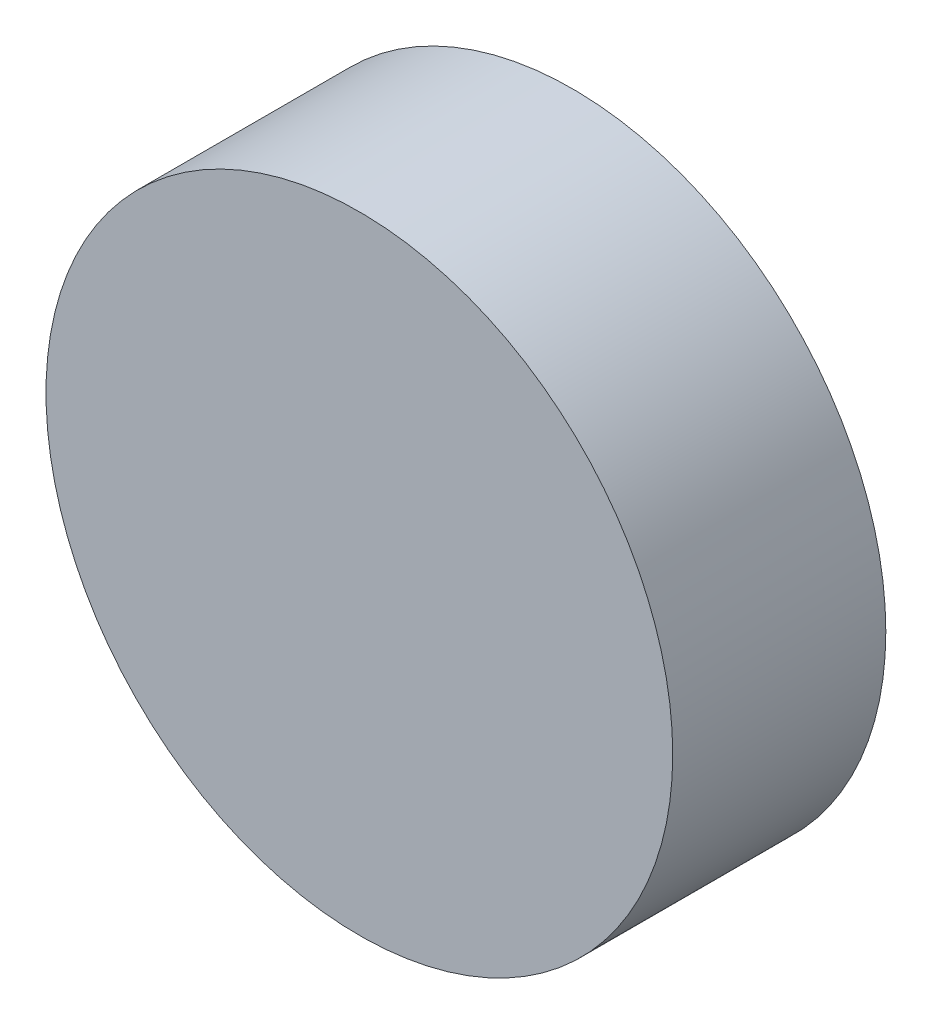
ISO-10303-21;
HEADER;
FILE_DESCRIPTION(('STEP AP214'),'2;1');
FILE_NAME('part.step','',(''),(''),'','','');
FILE_SCHEMA(('AUTOMOTIVE_DESIGN { 1 0 10303 214 1 1 1 1 }'));
ENDSEC;
DATA;
#1=APPLICATION_CONTEXT('core data for automotive mechanical design processes');
#2=APPLICATION_PROTOCOL_DEFINITION('international standard','automotive_design',2000,#1);
#3=PRODUCT_CONTEXT('',#1,'mechanical');
#4=PRODUCT('Part','Part','',(#3));
#5=PRODUCT_RELATED_PRODUCT_CATEGORY('part','',(#4));
#6=PRODUCT_DEFINITION_FORMATION('','',#4);
#7=PRODUCT_DEFINITION_CONTEXT('part definition',#1,'design');
#8=PRODUCT_DEFINITION('design','',#6,#7);
#9=PRODUCT_DEFINITION_SHAPE('','',#8);
#10=(LENGTH_UNIT() NAMED_UNIT(*) SI_UNIT(.MILLI.,.METRE.));
#11=(NAMED_UNIT(*) PLANE_ANGLE_UNIT() SI_UNIT($,.RADIAN.));
#12=(NAMED_UNIT(*) SI_UNIT($,.STERADIAN.) SOLID_ANGLE_UNIT());
#13=UNCERTAINTY_MEASURE_WITH_UNIT(LENGTH_MEASURE(1.E-05),#10,'distance_accuracy_value','');
#14=(GEOMETRIC_REPRESENTATION_CONTEXT(3) GLOBAL_UNCERTAINTY_ASSIGNED_CONTEXT((#13)) GLOBAL_UNIT_ASSIGNED_CONTEXT((#10,
#11,#12)) REPRESENTATION_CONTEXT('',''));
#15=CARTESIAN_POINT('',(0.,0.,0.));
#16=DIRECTION('',(0.,0.,1.));
#17=DIRECTION('',(1.,0.,0.));
#18=AXIS2_PLACEMENT_3D('',#15,#16,#17);
#19=CARTESIAN_POINT('',(0.,0.,0.));
#20=DIRECTION('',(0.,0.,1.));
#21=DIRECTION('',(1.,0.,0.));
#22=AXIS2_PLACEMENT_3D('',#19,#20,#21);
#23=PLANE('',#22);
#24=CARTESIAN_POINT('',(18.1865334794733,-10.4999999999998,0.));
#25=DIRECTION('',(0.,0.,-1.));
#26=DIRECTION('',(-1.,0.,0.));
#27=AXIS2_PLACEMENT_3D('',#24,#25,#26);
#28=CIRCLE('',#27,1.5);
#29=CARTESIAN_POINT('',(16.6865334794733,-10.4999999999998,0.));
#30=VERTEX_POINT('',#29);
#31=EDGE_CURVE('E209',#30,#30,#28,.T.);
#32=ORIENTED_EDGE('',*,*,#31,.F.);
#33=EDGE_LOOP('',(#32));
#34=FACE_BOUND('',#33,.T.);
#35=CARTESIAN_POINT('',(-18.1865334794732,-10.5000000000001,0.));
#36=DIRECTION('',(0.,0.,-1.));
#37=DIRECTION('',(-1.,0.,0.));
#38=AXIS2_PLACEMENT_3D('',#35,#36,#37);
#39=CIRCLE('',#38,1.5);
#40=CARTESIAN_POINT('',(-19.6865334794732,-10.5000000000001,0.));
#41=VERTEX_POINT('',#40);
#42=EDGE_CURVE('E221',#41,#41,#39,.T.);
#43=ORIENTED_EDGE('',*,*,#42,.F.);
#44=EDGE_LOOP('',(#43));
#45=FACE_BOUND('',#44,.T.);
#46=CARTESIAN_POINT('',(0.,21.,0.));
#47=DIRECTION('',(0.,0.,-1.));
#48=DIRECTION('',(-1.,0.,0.));
#49=AXIS2_PLACEMENT_3D('',#46,#47,#48);
#50=CIRCLE('',#49,1.5);
#51=CARTESIAN_POINT('',(-1.5,21.,0.));
#52=VERTEX_POINT('',#51);
#53=EDGE_CURVE('E227',#52,#52,#50,.T.);
#54=ORIENTED_EDGE('',*,*,#53,.F.);
#55=EDGE_LOOP('',(#54));
#56=FACE_BOUND('',#55,.T.);
#57=CARTESIAN_POINT('',(0.,0.,0.));
#58=DIRECTION('',(0.,0.,1.));
#59=DIRECTION('',(1.,0.,0.));
#60=AXIS2_PLACEMENT_3D('',#57,#58,#59);
#61=CIRCLE('',#60,25.);
#62=CARTESIAN_POINT('',(25.,0.,0.));
#63=VERTEX_POINT('',#62);
#64=EDGE_CURVE('E233',#63,#63,#61,.T.);
#65=ORIENTED_EDGE('',*,*,#64,.F.);
#66=EDGE_LOOP('',(#65));
#67=FACE_BOUND('',#66,.T.);
#68=CARTESIAN_POINT('',(-18.1865334794732,-10.5000000000001,0.));
#69=DIRECTION('',(0.,0.,1.));
#70=DIRECTION('',(-1.,0.,0.));
#71=AXIS2_PLACEMENT_3D('',#68,#69,#70);
#72=CIRCLE('',#71,4.);
#73=CARTESIAN_POINT('',(-15.8657099960918,-13.7578794267109,0.));
#74=VERTEX_POINT('',#73);
#75=CARTESIAN_POINT('',(-19.8475280837807,-6.86116819233691,0.));
#76=VERTEX_POINT('',#75);
#77=EDGE_CURVE('E167',#74,#76,#72,.T.);
#78=ORIENTED_EDGE('',*,*,#77,.F.);
#79=CARTESIAN_POINT('',(0.,0.,0.));
#80=DIRECTION('',(0.,0.,-1.));
#81=DIRECTION('',(-1.,0.,0.));
#82=AXIS2_PLACEMENT_3D('',#79,#80,#81);
#83=CIRCLE('',#82,21.);
#84=CARTESIAN_POINT('',(15.8657099960919,-13.7578794267106,0.));
#85=VERTEX_POINT('',#84);
#86=EDGE_CURVE('E48',#85,#74,#83,.T.);
#87=ORIENTED_EDGE('',*,*,#86,.F.);
#88=CARTESIAN_POINT('',(18.1865334794733,-10.4999999999998,0.));
#89=DIRECTION('',(0.,0.,1.));
#90=DIRECTION('',(-1.,0.,0.));
#91=AXIS2_PLACEMENT_3D('',#88,#89,#90);
#92=CIRCLE('',#91,4.);
#93=CARTESIAN_POINT('',(19.8475280837808,-6.86116819233663,0.));
#94=VERTEX_POINT('',#93);
#95=EDGE_CURVE('E141',#94,#85,#92,.T.);
#96=ORIENTED_EDGE('',*,*,#95,.F.);
#97=CARTESIAN_POINT('',(0.,0.,0.));
#98=DIRECTION('',(0.,0.,-1.));
#99=DIRECTION('',(-1.,0.,0.));
#100=AXIS2_PLACEMENT_3D('',#97,#98,#99);
#101=CIRCLE('',#100,21.);
#102=CARTESIAN_POINT('',(3.98181808768893,20.6190476190476,0.));
#103=VERTEX_POINT('',#102);
#104=EDGE_CURVE('E176',#103,#94,#101,.T.);
#105=ORIENTED_EDGE('',*,*,#104,.F.);
#106=CARTESIAN_POINT('',(0.,21.,0.));
#107=DIRECTION('',(0.,0.,1.));
#108=DIRECTION('',(-1.,0.,0.));
#109=AXIS2_PLACEMENT_3D('',#106,#107,#108);
#110=CIRCLE('',#109,4.);
#111=CARTESIAN_POINT('',(-3.98181808768894,20.6190476190476,0.));
#112=VERTEX_POINT('',#111);
#113=EDGE_CURVE('E173',#112,#103,#110,.T.);
#114=ORIENTED_EDGE('',*,*,#113,.F.);
#115=CARTESIAN_POINT('',(0.,0.,0.));
#116=DIRECTION('',(0.,0.,-1.));
#117=DIRECTION('',(-1.,0.,0.));
#118=AXIS2_PLACEMENT_3D('',#115,#116,#117);
#119=CIRCLE('',#118,21.);
#120=EDGE_CURVE('E170',#76,#112,#119,.T.);
#121=ORIENTED_EDGE('',*,*,#120,.F.);
#122=EDGE_LOOP('',(#78,#87,#96,#105,#114,#121));
#123=FACE_BOUND('',#122,.T.);
#124=ADVANCED_FACE('F33',(#34,#45,#56,#67,#123),#23,.F.);
#125=CARTESIAN_POINT('',(0.,-7.75,0.));
#126=DIRECTION('',(0.,-1.,0.));
#127=DIRECTION('',(1.,0.,0.));
#128=AXIS2_PLACEMENT_3D('',#125,#126,#127);
#129=PLANE('',#128);
#130=DIRECTION('',(0.,0.,-1.));
#131=VECTOR('',#130,1.);
#132=CARTESIAN_POINT('',(-6.98243317317344,-7.74999999999995,1.39785115936742));
#133=LINE('',#132,#131);
#134=CARTESIAN_POINT('',(-6.98243317317344,-7.74999999999995,15.3978511593674));
#135=VERTEX_POINT('',#134);
#136=CARTESIAN_POINT('',(-6.98243317317344,-7.74999999999996,15.));
#137=VERTEX_POINT('',#136);
#138=EDGE_CURVE('E197',#135,#137,#133,.T.);
#139=ORIENTED_EDGE('',*,*,#138,.T.);
#140=DIRECTION('',(1.,0.,0.));
#141=VECTOR('',#140,1.);
#142=CARTESIAN_POINT('',(0.,-7.75,15.));
#143=LINE('',#142,#141);
#144=CARTESIAN_POINT('',(8.66744619023216,-7.75000000000006,15.));
#145=VERTEX_POINT('',#144);
#146=EDGE_CURVE('E251',#137,#145,#143,.T.);
#147=ORIENTED_EDGE('',*,*,#146,.T.);
#148=DIRECTION('',(0.,0.,1.));
#149=VECTOR('',#148,1.);
#150=CARTESIAN_POINT('',(8.66744619023217,-7.75000000000006,1.39785115936742));
#151=LINE('',#150,#149);
#152=CARTESIAN_POINT('',(8.66744619023216,-7.75000000000006,15.3978511593674));
#153=VERTEX_POINT('',#152);
#154=EDGE_CURVE('E200',#145,#153,#151,.T.);
#155=ORIENTED_EDGE('',*,*,#154,.T.);
#156=DIRECTION('',(-1.,0.,0.));
#157=VECTOR('',#156,1.);
#158=CARTESIAN_POINT('',(8.66744619023216,-7.75000000000006,15.3978511593674));
#159=LINE('',#158,#157);
#160=EDGE_CURVE('E202',#153,#135,#159,.T.);
#161=ORIENTED_EDGE('',*,*,#160,.T.);
#162=EDGE_LOOP('',(#139,#147,#155,#161));
#163=FACE_BOUND('',#162,.T.);
#164=ADVANCED_FACE('F284',(#163),#129,.T.);
#165=CARTESIAN_POINT('',(0.,0.,17.));
#166=DIRECTION('',(0.,0.,-1.));
#167=DIRECTION('',(-1.,0.,0.));
#168=AXIS2_PLACEMENT_3D('',#165,#166,#167);
#169=CYLINDRICAL_SURFACE('',#168,25.);
#170=DIRECTION('',(0.,0.,-1.));
#171=VECTOR('',#170,1.);
#172=CARTESIAN_POINT('',(8.66744619023205,-23.4494216674832,17.));
#173=LINE('',#172,#171);
#174=CARTESIAN_POINT('',(8.66744619023205,-23.4494216674832,15.3978511593674));
#175=VERTEX_POINT('',#174);
#176=CARTESIAN_POINT('',(8.66744619023206,-23.4494216674832,1.39785115936742));
#177=VERTEX_POINT('',#176);
#178=EDGE_CURVE('E248',#175,#177,#173,.T.);
#179=ORIENTED_EDGE('',*,*,#178,.T.);
#180=CARTESIAN_POINT('',(0.,0.,1.39785115936742));
#181=DIRECTION('',(0.,0.,-1.));
#182=DIRECTION('',(-1.,0.,0.));
#183=AXIS2_PLACEMENT_3D('',#180,#181,#182);
#184=CIRCLE('',#183,25.);
#185=CARTESIAN_POINT('',(-6.98243317317356,-24.0051166833691,1.39785115936742));
#186=VERTEX_POINT('',#185);
#187=EDGE_CURVE('E237',#177,#186,#184,.T.);
#188=ORIENTED_EDGE('',*,*,#187,.T.);
#189=DIRECTION('',(0.,0.,-1.));
#190=VECTOR('',#189,1.);
#191=CARTESIAN_POINT('',(-6.98243317317356,-24.0051166833691,17.));
#192=LINE('',#191,#190);
#193=CARTESIAN_POINT('',(-6.98243317317356,-24.0051166833691,15.3978511593674));
#194=VERTEX_POINT('',#193);
#195=EDGE_CURVE('E245',#186,#194,#192,.F.);
#196=ORIENTED_EDGE('',*,*,#195,.T.);
#197=CARTESIAN_POINT('',(0.,0.,15.3978511593674));
#198=DIRECTION('',(0.,0.,1.));
#199=DIRECTION('',(1.,0.,0.));
#200=AXIS2_PLACEMENT_3D('',#197,#198,#199);
#201=CIRCLE('',#200,25.);
#202=EDGE_CURVE('E242',#194,#175,#201,.T.);
#203=ORIENTED_EDGE('',*,*,#202,.T.);
#204=EDGE_LOOP('',(#179,#188,#196,#203));
#205=FACE_BOUND('',#204,.T.);
#206=CARTESIAN_POINT('',(0.,0.,17.));
#207=DIRECTION('',(0.,0.,1.));
#208=DIRECTION('',(1.,0.,0.));
#209=AXIS2_PLACEMENT_3D('',#206,#207,#208);
#210=CIRCLE('',#209,25.);
#211=CARTESIAN_POINT('',(25.,0.,17.));
#212=VERTEX_POINT('',#211);
#213=EDGE_CURVE('E234',#212,#212,#210,.T.);
#214=ORIENTED_EDGE('',*,*,#213,.F.);
#215=EDGE_LOOP('',(#214));
#216=FACE_BOUND('',#215,.T.);
#217=ORIENTED_EDGE('',*,*,#64,.T.);
#218=EDGE_LOOP('',(#217));
#219=FACE_BOUND('',#218,.T.);
#220=ADVANCED_FACE('F35',(#205,#216,#219),#169,.T.);
#221=CARTESIAN_POINT('',(0.,0.,17.));
#222=DIRECTION('',(0.,0.,1.));
#223=DIRECTION('',(1.,0.,0.));
#224=AXIS2_PLACEMENT_3D('',#221,#222,#223);
#225=PLANE('',#224);
#226=ORIENTED_EDGE('',*,*,#213,.T.);
#227=EDGE_LOOP('',(#226));
#228=FACE_BOUND('',#227,.T.);
#229=ADVANCED_FACE('F294',(#228),#225,.T.);
#230=CARTESIAN_POINT('',(0.,21.,5.));
#231=DIRECTION('',(0.,0.,-1.));
#232=DIRECTION('',(-1.,0.,0.));
#233=AXIS2_PLACEMENT_3D('',#230,#231,#232);
#234=CONICAL_SURFACE('',#233,1.5,1.02974425867665);
#235=CARTESIAN_POINT('',(0.,21.,5.90129092854134));
#236=VERTEX_POINT('',#235);
#237=VERTEX_LOOP('',#236);
#238=FACE_BOUND('',#237,.T.);
#239=CARTESIAN_POINT('',(0.,21.,5.));
#240=DIRECTION('',(0.,0.,-1.));
#241=DIRECTION('',(-1.,0.,0.));
#242=AXIS2_PLACEMENT_3D('',#239,#240,#241);
#243=CIRCLE('',#242,1.5);
#244=CARTESIAN_POINT('',(-1.5,21.,5.));
#245=VERTEX_POINT('',#244);
#246=EDGE_CURVE('E230',#245,#245,#243,.T.);
#247=ORIENTED_EDGE('',*,*,#246,.T.);
#248=EDGE_LOOP('',(#247));
#249=FACE_BOUND('',#248,.T.);
#250=ADVANCED_FACE('F297',(#238,#249),#234,.F.);
#251=CARTESIAN_POINT('',(0.,21.,0.));
#252=DIRECTION('',(0.,0.,-1.));
#253=DIRECTION('',(-1.,0.,0.));
#254=AXIS2_PLACEMENT_3D('',#251,#252,#253);
#255=CYLINDRICAL_SURFACE('',#254,1.5);
#256=ORIENTED_EDGE('',*,*,#246,.F.);
#257=EDGE_LOOP('',(#256));
#258=FACE_BOUND('',#257,.T.);
#259=ORIENTED_EDGE('',*,*,#53,.T.);
#260=EDGE_LOOP('',(#259));
#261=FACE_BOUND('',#260,.T.);
#262=ADVANCED_FACE('F301',(#258,#261),#255,.F.);
#263=CARTESIAN_POINT('',(-18.1865334794732,-10.5000000000001,5.));
#264=DIRECTION('',(0.,0.,-1.));
#265=DIRECTION('',(-1.,0.,0.));
#266=AXIS2_PLACEMENT_3D('',#263,#264,#265);
#267=CONICAL_SURFACE('',#266,1.5,1.02974425867665);
#268=CARTESIAN_POINT('',(-18.1865334794732,-10.5000000000001,5.90129092854134));
#269=VERTEX_POINT('',#268);
#270=VERTEX_LOOP('',#269);
#271=FACE_BOUND('',#270,.T.);
#272=CARTESIAN_POINT('',(-18.1865334794732,-10.5000000000001,5.));
#273=DIRECTION('',(0.,0.,-1.));
#274=DIRECTION('',(-1.,0.,0.));
#275=AXIS2_PLACEMENT_3D('',#272,#273,#274);
#276=CIRCLE('',#275,1.5);
#277=CARTESIAN_POINT('',(-19.6865334794732,-10.5000000000001,5.));
#278=VERTEX_POINT('',#277);
#279=EDGE_CURVE('E224',#278,#278,#276,.T.);
#280=ORIENTED_EDGE('',*,*,#279,.T.);
#281=EDGE_LOOP('',(#280));
#282=FACE_BOUND('',#281,.T.);
#283=ADVANCED_FACE('F305',(#271,#282),#267,.F.);
#284=CARTESIAN_POINT('',(-18.1865334794732,-10.5000000000001,0.));
#285=DIRECTION('',(0.,0.,-1.));
#286=DIRECTION('',(-1.,0.,0.));
#287=AXIS2_PLACEMENT_3D('',#284,#285,#286);
#288=CYLINDRICAL_SURFACE('',#287,1.5);
#289=ORIENTED_EDGE('',*,*,#279,.F.);
#290=EDGE_LOOP('',(#289));
#291=FACE_BOUND('',#290,.T.);
#292=ORIENTED_EDGE('',*,*,#42,.T.);
#293=EDGE_LOOP('',(#292));
#294=FACE_BOUND('',#293,.T.);
#295=ADVANCED_FACE('F309',(#291,#294),#288,.F.);
#296=CARTESIAN_POINT('',(18.1865334794733,-10.4999999999998,5.));
#297=DIRECTION('',(0.,0.,-1.));
#298=DIRECTION('',(-1.,0.,0.));
#299=AXIS2_PLACEMENT_3D('',#296,#297,#298);
#300=CONICAL_SURFACE('',#299,1.5,1.02974425867665);
#301=CARTESIAN_POINT('',(18.1865334794733,-10.4999999999998,5.90129092854134));
#302=VERTEX_POINT('',#301);
#303=VERTEX_LOOP('',#302);
#304=FACE_BOUND('',#303,.T.);
#305=CARTESIAN_POINT('',(18.1865334794733,-10.4999999999998,5.));
#306=DIRECTION('',(0.,0.,-1.));
#307=DIRECTION('',(-1.,0.,0.));
#308=AXIS2_PLACEMENT_3D('',#305,#306,#307);
#309=CIRCLE('',#308,1.5);
#310=CARTESIAN_POINT('',(16.6865334794733,-10.4999999999998,5.));
#311=VERTEX_POINT('',#310);
#312=EDGE_CURVE('E218',#311,#311,#309,.T.);
#313=ORIENTED_EDGE('',*,*,#312,.T.);
#314=EDGE_LOOP('',(#313));
#315=FACE_BOUND('',#314,.T.);
#316=ADVANCED_FACE('F313',(#304,#315),#300,.F.);
#317=CARTESIAN_POINT('',(18.1865334794733,-10.4999999999998,0.));
#318=DIRECTION('',(0.,0.,-1.));
#319=DIRECTION('',(-1.,0.,0.));
#320=AXIS2_PLACEMENT_3D('',#317,#318,#319);
#321=CYLINDRICAL_SURFACE('',#320,1.5);
#322=ORIENTED_EDGE('',*,*,#312,.F.);
#323=EDGE_LOOP('',(#322));
#324=FACE_BOUND('',#323,.T.);
#325=ORIENTED_EDGE('',*,*,#31,.T.);
#326=EDGE_LOOP('',(#325));
#327=FACE_BOUND('',#326,.T.);
#328=ADVANCED_FACE('F317',(#324,#327),#321,.F.);
#329=CARTESIAN_POINT('',(-6.98243317317344,-7.74999999999995,1.39785115936742));
#330=DIRECTION('',(-1.,0.,0.));
#331=DIRECTION('',(0.,-1.,0.));
#332=AXIS2_PLACEMENT_3D('',#329,#330,#331);
#333=PLANE('',#332);
#334=DIRECTION('',(0.,-1.,0.));
#335=VECTOR('',#334,1.);
#336=CARTESIAN_POINT('',(-6.98243317317344,-7.74999999999995,1.39785115936742));
#337=LINE('',#336,#335);
#338=CARTESIAN_POINT('',(-6.98243317317353,-19.8051919198519,1.39785115936742));
#339=VERTEX_POINT('',#338);
#340=EDGE_CURVE('E205',#339,#186,#337,.T.);
#341=ORIENTED_EDGE('',*,*,#340,.F.);
#342=DIRECTION('',(0.,0.,-1.));
#343=VECTOR('',#342,1.);
#344=CARTESIAN_POINT('',(-6.98243317317353,-19.8051919198519,15.));
#345=LINE('',#344,#343);
#346=CARTESIAN_POINT('',(-6.98243317317353,-19.8051919198519,15.));
#347=VERTEX_POINT('',#346);
#348=EDGE_CURVE('E195',#339,#347,#345,.F.);
#349=ORIENTED_EDGE('',*,*,#348,.T.);
#350=DIRECTION('',(0.,-1.,0.));
#351=VECTOR('',#350,1.);
#352=CARTESIAN_POINT('',(-6.98243317317344,-7.74999999999995,15.));
#353=LINE('',#352,#351);
#354=EDGE_CURVE('E138',#137,#347,#353,.T.);
#355=ORIENTED_EDGE('',*,*,#354,.F.);
#356=ORIENTED_EDGE('',*,*,#138,.F.);
#357=DIRECTION('',(0.,-1.,0.));
#358=VECTOR('',#357,1.);
#359=CARTESIAN_POINT('',(-6.98243317317344,-7.74999999999995,15.3978511593674));
#360=LINE('',#359,#358);
#361=EDGE_CURVE('E206',#135,#194,#360,.T.);
#362=ORIENTED_EDGE('',*,*,#361,.T.);
#363=ORIENTED_EDGE('',*,*,#195,.F.);
#364=EDGE_LOOP('',(#341,#349,#355,#356,#362,#363));
#365=FACE_BOUND('',#364,.T.);
#366=ADVANCED_FACE('F321',(#365),#333,.F.);
#367=CARTESIAN_POINT('',(8.66744619023216,-7.75000000000006,15.3978511593674));
#368=DIRECTION('',(0.,0.,1.));
#369=DIRECTION('',(1.,0.,0.));
#370=AXIS2_PLACEMENT_3D('',#367,#368,#369);
#371=PLANE('',#370);
#372=ORIENTED_EDGE('',*,*,#361,.F.);
#373=ORIENTED_EDGE('',*,*,#160,.F.);
#374=DIRECTION('',(0.,-1.,0.));
#375=VECTOR('',#374,1.);
#376=CARTESIAN_POINT('',(8.66744619023216,-7.75000000000006,15.3978511593674));
#377=LINE('',#376,#375);
#378=EDGE_CURVE('E210',#153,#175,#377,.T.);
#379=ORIENTED_EDGE('',*,*,#378,.T.);
#380=ORIENTED_EDGE('',*,*,#202,.F.);
#381=EDGE_LOOP('',(#372,#373,#379,#380));
#382=FACE_BOUND('',#381,.T.);
#383=ADVANCED_FACE('F325',(#382),#371,.F.);
#384=CARTESIAN_POINT('',(8.66744619023217,-7.75000000000006,1.39785115936742));
#385=DIRECTION('',(1.,0.,0.));
#386=DIRECTION('',(0.,1.,0.));
#387=AXIS2_PLACEMENT_3D('',#384,#385,#386);
#388=PLANE('',#387);
#389=DIRECTION('',(0.,1.,0.));
#390=VECTOR('',#389,1.);
#391=CARTESIAN_POINT('',(8.66744619023216,-7.75000000000006,15.));
#392=LINE('',#391,#390);
#393=CARTESIAN_POINT('',(8.66744619023208,-19.1278691060827,15.));
#394=VERTEX_POINT('',#393);
#395=EDGE_CURVE('E56',#394,#145,#392,.T.);
#396=ORIENTED_EDGE('',*,*,#395,.F.);
#397=DIRECTION('',(0.,0.,-1.));
#398=VECTOR('',#397,1.);
#399=CARTESIAN_POINT('',(8.66744619023208,-19.1278691060827,15.));
#400=LINE('',#399,#398);
#401=CARTESIAN_POINT('',(8.66744619023209,-19.1278691060827,1.39785115936742));
#402=VERTEX_POINT('',#401);
#403=EDGE_CURVE('E192',#394,#402,#400,.T.);
#404=ORIENTED_EDGE('',*,*,#403,.T.);
#405=DIRECTION('',(0.,-1.,0.));
#406=VECTOR('',#405,1.);
#407=CARTESIAN_POINT('',(8.66744619023217,-7.75000000000006,1.39785115936742));
#408=LINE('',#407,#406);
#409=EDGE_CURVE('E213',#402,#177,#408,.T.);
#410=ORIENTED_EDGE('',*,*,#409,.T.);
#411=ORIENTED_EDGE('',*,*,#178,.F.);
#412=ORIENTED_EDGE('',*,*,#378,.F.);
#413=ORIENTED_EDGE('',*,*,#154,.F.);
#414=EDGE_LOOP('',(#396,#404,#410,#411,#412,#413));
#415=FACE_BOUND('',#414,.T.);
#416=ADVANCED_FACE('F330',(#415),#388,.F.);
#417=CARTESIAN_POINT('',(8.66744619023217,-7.75000000000006,1.39785115936742));
#418=DIRECTION('',(0.,0.,-1.));
#419=DIRECTION('',(-1.,0.,0.));
#420=AXIS2_PLACEMENT_3D('',#417,#418,#419);
#421=PLANE('',#420);
#422=ORIENTED_EDGE('',*,*,#409,.F.);
#423=CARTESIAN_POINT('',(0.,0.,1.39785115936742));
#424=DIRECTION('',(0.,0.,-1.));
#425=DIRECTION('',(-1.,0.,0.));
#426=AXIS2_PLACEMENT_3D('',#423,#424,#425);
#427=CIRCLE('',#426,21.);
#428=EDGE_CURVE('E253',#402,#339,#427,.T.);
#429=ORIENTED_EDGE('',*,*,#428,.T.);
#430=ORIENTED_EDGE('',*,*,#340,.T.);
#431=ORIENTED_EDGE('',*,*,#187,.F.);
#432=EDGE_LOOP('',(#422,#429,#430,#431));
#433=FACE_BOUND('',#432,.T.);
#434=ADVANCED_FACE('F327',(#433),#421,.F.);
#435=CARTESIAN_POINT('',(0.,0.,15.));
#436=DIRECTION('',(0.,0.,-1.));
#437=DIRECTION('',(-1.,0.,0.));
#438=AXIS2_PLACEMENT_3D('',#435,#436,#437);
#439=CYLINDRICAL_SURFACE('',#438,21.);
#440=ORIENTED_EDGE('',*,*,#428,.F.);
#441=ORIENTED_EDGE('',*,*,#403,.F.);
#442=CARTESIAN_POINT('',(0.,0.,15.));
#443=DIRECTION('',(0.,0.,-1.));
#444=DIRECTION('',(-1.,0.,0.));
#445=AXIS2_PLACEMENT_3D('',#442,#443,#444);
#446=CIRCLE('',#445,21.);
#447=CARTESIAN_POINT('',(15.8657099960919,-13.7578794267106,15.));
#448=VERTEX_POINT('',#447);
#449=EDGE_CURVE('E140',#448,#394,#446,.T.);
#450=ORIENTED_EDGE('',*,*,#449,.F.);
#451=DIRECTION('',(0.,0.,-1.));
#452=VECTOR('',#451,1.);
#453=CARTESIAN_POINT('',(15.8657099960919,-13.7578794267106,15.));
#454=LINE('',#453,#452);
#455=EDGE_CURVE('E181',#448,#85,#454,.T.);
#456=ORIENTED_EDGE('',*,*,#455,.T.);
#457=ORIENTED_EDGE('',*,*,#86,.T.);
#458=DIRECTION('',(0.,0.,-1.));
#459=VECTOR('',#458,1.);
#460=CARTESIAN_POINT('',(-15.8657099960918,-13.7578794267109,15.));
#461=LINE('',#460,#459);
#462=CARTESIAN_POINT('',(-15.8657099960918,-13.7578794267109,15.));
#463=VERTEX_POINT('',#462);
#464=EDGE_CURVE('E143',#463,#74,#461,.T.);
#465=ORIENTED_EDGE('',*,*,#464,.F.);
#466=EDGE_CURVE('E132',#347,#463,#446,.T.);
#467=ORIENTED_EDGE('',*,*,#466,.F.);
#468=ORIENTED_EDGE('',*,*,#348,.F.);
#469=EDGE_LOOP('',(#440,#441,#450,#456,#457,#465,#467,#468));
#470=FACE_BOUND('',#469,.T.);
#471=ADVANCED_FACE('F144',(#470),#439,.F.);
#472=CARTESIAN_POINT('',(-9.09326673973658,-5.25000000000004,15.));
#473=DIRECTION('',(0.,0.,-1.));
#474=DIRECTION('',(-1.,0.,0.));
#475=AXIS2_PLACEMENT_3D('',#472,#473,#474);
#476=PLANE('',#475);
#477=CARTESIAN_POINT('',(-7.,8.03883281399028,15.));
#478=DIRECTION('',(0.,0.,-1.));
#479=DIRECTION('',(1.,0.,0.));
#480=AXIS2_PLACEMENT_3D('',#477,#478,#479);
#481=CIRCLE('',#480,2.);
#482=CARTESIAN_POINT('',(-5.,8.03883281399028,15.));
#483=VERTEX_POINT('',#482);
#484=EDGE_CURVE('E510',#483,#483,#481,.T.);
#485=ORIENTED_EDGE('',*,*,#484,.F.);
#486=EDGE_LOOP('',(#485));
#487=FACE_BOUND('',#486,.T.);
#488=CARTESIAN_POINT('',(7.,8.03883281399028,15.));
#489=DIRECTION('',(0.,0.,-1.));
#490=DIRECTION('',(-1.,0.,0.));
#491=AXIS2_PLACEMENT_3D('',#488,#489,#490);
#492=CIRCLE('',#491,2.);
#493=CARTESIAN_POINT('',(5.,8.03883281399028,15.));
#494=VERTEX_POINT('',#493);
#495=EDGE_CURVE('E521',#494,#494,#492,.T.);
#496=ORIENTED_EDGE('',*,*,#495,.F.);
#497=EDGE_LOOP('',(#496));
#498=FACE_BOUND('',#497,.T.);
#499=ORIENTED_EDGE('',*,*,#354,.T.);
#500=ORIENTED_EDGE('',*,*,#466,.T.);
#501=CARTESIAN_POINT('',(-18.1865334794732,-10.5000000000001,15.));
#502=DIRECTION('',(0.,0.,1.));
#503=DIRECTION('',(-1.,0.,0.));
#504=AXIS2_PLACEMENT_3D('',#501,#502,#503);
#505=CIRCLE('',#504,4.);
#506=CARTESIAN_POINT('',(-19.8475280837807,-6.86116819233691,15.));
#507=VERTEX_POINT('',#506);
#508=EDGE_CURVE('E136',#463,#507,#505,.T.);
#509=ORIENTED_EDGE('',*,*,#508,.T.);
#510=CARTESIAN_POINT('',(0.,0.,15.));
#511=DIRECTION('',(0.,0.,-1.));
#512=DIRECTION('',(-1.,0.,0.));
#513=AXIS2_PLACEMENT_3D('',#510,#511,#512);
#514=CIRCLE('',#513,21.);
#515=CARTESIAN_POINT('',(-3.98181808768894,20.6190476190476,15.));
#516=VERTEX_POINT('',#515);
#517=EDGE_CURVE('E153',#507,#516,#514,.T.);
#518=ORIENTED_EDGE('',*,*,#517,.T.);
#519=CARTESIAN_POINT('',(0.,21.,15.));
#520=DIRECTION('',(0.,0.,1.));
#521=DIRECTION('',(-1.,0.,0.));
#522=AXIS2_PLACEMENT_3D('',#519,#520,#521);
#523=CIRCLE('',#522,4.);
#524=CARTESIAN_POINT('',(3.98181808768893,20.6190476190476,15.));
#525=VERTEX_POINT('',#524);
#526=EDGE_CURVE('E155',#516,#525,#523,.T.);
#527=ORIENTED_EDGE('',*,*,#526,.T.);
#528=CARTESIAN_POINT('',(0.,0.,15.));
#529=DIRECTION('',(0.,0.,-1.));
#530=DIRECTION('',(-1.,0.,0.));
#531=AXIS2_PLACEMENT_3D('',#528,#529,#530);
#532=CIRCLE('',#531,21.);
#533=CARTESIAN_POINT('',(19.8475280837808,-6.86116819233663,15.));
#534=VERTEX_POINT('',#533);
#535=EDGE_CURVE('E161',#525,#534,#532,.T.);
#536=ORIENTED_EDGE('',*,*,#535,.T.);
#537=CARTESIAN_POINT('',(18.1865334794733,-10.4999999999998,15.));
#538=DIRECTION('',(0.,0.,1.));
#539=DIRECTION('',(-1.,0.,0.));
#540=AXIS2_PLACEMENT_3D('',#537,#538,#539);
#541=CIRCLE('',#540,4.);
#542=EDGE_CURVE('E149',#534,#448,#541,.T.);
#543=ORIENTED_EDGE('',*,*,#542,.T.);
#544=ORIENTED_EDGE('',*,*,#449,.T.);
#545=ORIENTED_EDGE('',*,*,#395,.T.);
#546=ORIENTED_EDGE('',*,*,#146,.F.);
#547=EDGE_LOOP('',(#499,#500,#509,#518,#527,#536,#543,#544,#545,#546));
#548=FACE_BOUND('',#547,.T.);
#549=ADVANCED_FACE('F133',(#487,#498,#548),#476,.T.);
#550=CARTESIAN_POINT('',(18.1865334794733,-10.4999999999998,15.));
#551=DIRECTION('',(0.,0.,-1.));
#552=DIRECTION('',(-1.,0.,0.));
#553=AXIS2_PLACEMENT_3D('',#550,#551,#552);
#554=CYLINDRICAL_SURFACE('',#553,4.);
#555=ORIENTED_EDGE('',*,*,#95,.T.);
#556=ORIENTED_EDGE('',*,*,#455,.F.);
#557=ORIENTED_EDGE('',*,*,#542,.F.);
#558=DIRECTION('',(0.,0.,-1.));
#559=VECTOR('',#558,1.);
#560=CARTESIAN_POINT('',(19.8475280837808,-6.86116819233663,15.));
#561=LINE('',#560,#559);
#562=EDGE_CURVE('E183',#534,#94,#561,.T.);
#563=ORIENTED_EDGE('',*,*,#562,.T.);
#564=EDGE_LOOP('',(#555,#556,#557,#563));
#565=FACE_BOUND('',#564,.T.);
#566=ADVANCED_FACE('F278',(#565),#554,.T.);
#567=CARTESIAN_POINT('',(0.,0.,15.));
#568=DIRECTION('',(0.,0.,-1.));
#569=DIRECTION('',(-1.,0.,0.));
#570=AXIS2_PLACEMENT_3D('',#567,#568,#569);
#571=CYLINDRICAL_SURFACE('',#570,21.);
#572=ORIENTED_EDGE('',*,*,#104,.T.);
#573=ORIENTED_EDGE('',*,*,#562,.F.);
#574=ORIENTED_EDGE('',*,*,#535,.F.);
#575=DIRECTION('',(0.,0.,-1.));
#576=VECTOR('',#575,1.);
#577=CARTESIAN_POINT('',(3.98181808768893,20.6190476190476,15.));
#578=LINE('',#577,#576);
#579=EDGE_CURVE('E185',#525,#103,#578,.T.);
#580=ORIENTED_EDGE('',*,*,#579,.T.);
#581=EDGE_LOOP('',(#572,#573,#574,#580));
#582=FACE_BOUND('',#581,.T.);
#583=ADVANCED_FACE('F350',(#582),#571,.F.);
#584=CARTESIAN_POINT('',(0.,21.,15.));
#585=DIRECTION('',(0.,0.,-1.));
#586=DIRECTION('',(-1.,0.,0.));
#587=AXIS2_PLACEMENT_3D('',#584,#585,#586);
#588=CYLINDRICAL_SURFACE('',#587,4.);
#589=ORIENTED_EDGE('',*,*,#113,.T.);
#590=ORIENTED_EDGE('',*,*,#579,.F.);
#591=ORIENTED_EDGE('',*,*,#526,.F.);
#592=DIRECTION('',(0.,0.,-1.));
#593=VECTOR('',#592,1.);
#594=CARTESIAN_POINT('',(-3.98181808768894,20.6190476190476,15.));
#595=LINE('',#594,#593);
#596=EDGE_CURVE('E187',#516,#112,#595,.T.);
#597=ORIENTED_EDGE('',*,*,#596,.T.);
#598=EDGE_LOOP('',(#589,#590,#591,#597));
#599=FACE_BOUND('',#598,.T.);
#600=ADVANCED_FACE('F346',(#599),#588,.T.);
#601=CARTESIAN_POINT('',(0.,0.,15.));
#602=DIRECTION('',(0.,0.,-1.));
#603=DIRECTION('',(-1.,0.,0.));
#604=AXIS2_PLACEMENT_3D('',#601,#602,#603);
#605=CYLINDRICAL_SURFACE('',#604,21.);
#606=ORIENTED_EDGE('',*,*,#120,.T.);
#607=ORIENTED_EDGE('',*,*,#596,.F.);
#608=ORIENTED_EDGE('',*,*,#517,.F.);
#609=DIRECTION('',(0.,0.,-1.));
#610=VECTOR('',#609,1.);
#611=CARTESIAN_POINT('',(-19.8475280837807,-6.86116819233691,15.));
#612=LINE('',#611,#610);
#613=EDGE_CURVE('E148',#507,#76,#612,.T.);
#614=ORIENTED_EDGE('',*,*,#613,.T.);
#615=EDGE_LOOP('',(#606,#607,#608,#614));
#616=FACE_BOUND('',#615,.T.);
#617=ADVANCED_FACE('F343',(#616),#605,.F.);
#618=CARTESIAN_POINT('',(-18.1865334794732,-10.5000000000001,15.));
#619=DIRECTION('',(0.,0.,-1.));
#620=DIRECTION('',(-1.,0.,0.));
#621=AXIS2_PLACEMENT_3D('',#618,#619,#620);
#622=CYLINDRICAL_SURFACE('',#621,4.);
#623=ORIENTED_EDGE('',*,*,#77,.T.);
#624=ORIENTED_EDGE('',*,*,#613,.F.);
#625=ORIENTED_EDGE('',*,*,#508,.F.);
#626=ORIENTED_EDGE('',*,*,#464,.T.);
#627=EDGE_LOOP('',(#623,#624,#625,#626));
#628=FACE_BOUND('',#627,.T.);
#629=ADVANCED_FACE('F151',(#628),#622,.T.);
#630=CARTESIAN_POINT('',(7.,8.03883281399028,12.));
#631=DIRECTION('',(0.,0.,-1.));
#632=DIRECTION('',(-1.,0.,0.));
#633=AXIS2_PLACEMENT_3D('',#630,#631,#632);
#634=PLANE('',#633);
#635=CARTESIAN_POINT('',(7.,8.03883281399028,12.));
#636=DIRECTION('',(0.,0.,-1.));
#637=DIRECTION('',(-1.,0.,0.));
#638=AXIS2_PLACEMENT_3D('',#635,#636,#637);
#639=CIRCLE('',#638,2.);
#640=CARTESIAN_POINT('',(5.,8.03883281399028,12.));
#641=VERTEX_POINT('',#640);
#642=EDGE_CURVE('E168',#641,#641,#639,.T.);
#643=ORIENTED_EDGE('',*,*,#642,.T.);
#644=EDGE_LOOP('',(#643));
#645=FACE_BOUND('',#644,.T.);
#646=CARTESIAN_POINT('',(7.,8.03883281399028,12.));
#647=DIRECTION('',(0.,0.,-1.));
#648=DIRECTION('',(-1.,0.,0.));
#649=AXIS2_PLACEMENT_3D('',#646,#647,#648);
#650=CIRCLE('',#649,1.);
#651=CARTESIAN_POINT('',(6.,8.03883281399028,12.));
#652=VERTEX_POINT('',#651);
#653=EDGE_CURVE('E517',#652,#652,#650,.T.);
#654=ORIENTED_EDGE('',*,*,#653,.F.);
#655=EDGE_LOOP('',(#654));
#656=FACE_BOUND('',#655,.T.);
#657=ADVANCED_FACE('F342',(#645,#656),#634,.T.);
#658=CARTESIAN_POINT('',(7.,8.03883281399028,12.));
#659=DIRECTION('',(0.,0.,1.));
#660=DIRECTION('',(1.,0.,0.));
#661=AXIS2_PLACEMENT_3D('',#658,#659,#660);
#662=CYLINDRICAL_SURFACE('',#661,2.);
#663=ORIENTED_EDGE('',*,*,#642,.F.);
#664=EDGE_LOOP('',(#663));
#665=FACE_BOUND('',#664,.T.);
#666=ORIENTED_EDGE('',*,*,#495,.T.);
#667=EDGE_LOOP('',(#666));
#668=FACE_BOUND('',#667,.T.);
#669=ADVANCED_FACE('F272',(#665,#668),#662,.T.);
#670=CARTESIAN_POINT('',(7.,8.03883281399028,12.));
#671=DIRECTION('',(0.,0.,1.));
#672=DIRECTION('',(1.,0.,0.));
#673=AXIS2_PLACEMENT_3D('',#670,#671,#672);
#674=CYLINDRICAL_SURFACE('',#673,1.);
#675=ORIENTED_EDGE('',*,*,#653,.T.);
#676=EDGE_LOOP('',(#675));
#677=FACE_BOUND('',#676,.T.);
#678=CARTESIAN_POINT('',(7.,8.03883281399028,15.));
#679=DIRECTION('',(0.,0.,-1.));
#680=DIRECTION('',(-1.,0.,0.));
#681=AXIS2_PLACEMENT_3D('',#678,#679,#680);
#682=CIRCLE('',#681,1.);
#683=CARTESIAN_POINT('',(6.,8.03883281399028,15.));
#684=VERTEX_POINT('',#683);
#685=EDGE_CURVE('E41',#684,#684,#682,.F.);
#686=ORIENTED_EDGE('',*,*,#685,.T.);
#687=EDGE_LOOP('',(#686));
#688=FACE_BOUND('',#687,.T.);
#689=ADVANCED_FACE('F258',(#677,#688),#674,.F.);
#690=ORIENTED_EDGE('',*,*,#685,.F.);
#691=EDGE_LOOP('',(#690));
#692=FACE_BOUND('',#691,.T.);
#693=ADVANCED_FACE('F260',(#692),#476,.T.);
#694=CARTESIAN_POINT('',(-7.,8.03883281399028,12.));
#695=DIRECTION('',(0.,0.,1.));
#696=DIRECTION('',(1.,0.,0.));
#697=AXIS2_PLACEMENT_3D('',#694,#695,#696);
#698=PLANE('',#697);
#699=CARTESIAN_POINT('',(-7.,8.03883281399028,12.));
#700=DIRECTION('',(0.,0.,-1.));
#701=DIRECTION('',(1.,0.,0.));
#702=AXIS2_PLACEMENT_3D('',#699,#700,#701);
#703=CIRCLE('',#702,2.);
#704=CARTESIAN_POINT('',(-5.,8.03883281399028,12.));
#705=VERTEX_POINT('',#704);
#706=EDGE_CURVE('E513',#705,#705,#703,.T.);
#707=ORIENTED_EDGE('',*,*,#706,.T.);
#708=EDGE_LOOP('',(#707));
#709=FACE_BOUND('',#708,.T.);
#710=CARTESIAN_POINT('',(-7.,8.03883281399028,12.));
#711=DIRECTION('',(0.,0.,-1.));
#712=DIRECTION('',(1.,0.,0.));
#713=AXIS2_PLACEMENT_3D('',#710,#711,#712);
#714=CIRCLE('',#713,1.);
#715=CARTESIAN_POINT('',(-6.,8.03883281399028,12.));
#716=VERTEX_POINT('',#715);
#717=EDGE_CURVE('E507',#716,#716,#714,.T.);
#718=ORIENTED_EDGE('',*,*,#717,.F.);
#719=EDGE_LOOP('',(#718));
#720=FACE_BOUND('',#719,.T.);
#721=ADVANCED_FACE('F262',(#709,#720),#698,.F.);
#722=CARTESIAN_POINT('',(-7.,8.03883281399028,12.));
#723=DIRECTION('',(0.,0.,1.));
#724=DIRECTION('',(1.,0.,0.));
#725=AXIS2_PLACEMENT_3D('',#722,#723,#724);
#726=CYLINDRICAL_SURFACE('',#725,2.);
#727=ORIENTED_EDGE('',*,*,#706,.F.);
#728=EDGE_LOOP('',(#727));
#729=FACE_BOUND('',#728,.T.);
#730=ORIENTED_EDGE('',*,*,#484,.T.);
#731=EDGE_LOOP('',(#730));
#732=FACE_BOUND('',#731,.T.);
#733=ADVANCED_FACE('F269',(#729,#732),#726,.T.);
#734=CARTESIAN_POINT('',(-7.,8.03883281399028,12.));
#735=DIRECTION('',(0.,0.,1.));
#736=DIRECTION('',(1.,0.,0.));
#737=AXIS2_PLACEMENT_3D('',#734,#735,#736);
#738=CYLINDRICAL_SURFACE('',#737,1.);
#739=ORIENTED_EDGE('',*,*,#717,.T.);
#740=EDGE_LOOP('',(#739));
#741=FACE_BOUND('',#740,.T.);
#742=CARTESIAN_POINT('',(-7.,8.03883281399028,15.));
#743=DIRECTION('',(0.,0.,-1.));
#744=DIRECTION('',(-1.,0.,0.));
#745=AXIS2_PLACEMENT_3D('',#742,#743,#744);
#746=CIRCLE('',#745,1.);
#747=CARTESIAN_POINT('',(-8.,8.03883281399028,15.));
#748=VERTEX_POINT('',#747);
#749=EDGE_CURVE('E11',#748,#748,#746,.F.);
#750=ORIENTED_EDGE('',*,*,#749,.T.);
#751=EDGE_LOOP('',(#750));
#752=FACE_BOUND('',#751,.T.);
#753=ADVANCED_FACE('F281',(#741,#752),#738,.F.);
#754=ORIENTED_EDGE('',*,*,#749,.F.);
#755=EDGE_LOOP('',(#754));
#756=FACE_BOUND('',#755,.T.);
#757=ADVANCED_FACE('F264',(#756),#476,.T.);
#758=CLOSED_SHELL('',(#124,#164,#220,#229,#250,#262,#283,#295,#316,#328,#366,#383,#416,#434,
#471,#549,#566,#583,#600,#617,#629,#657,#669,#689,#693,#721,#733,#753,#757));
#759=MANIFOLD_SOLID_BREP('B2',#758);
#760=ADVANCED_BREP_SHAPE_REPRESENTATION('',(#18,#759),#14);
#761=SHAPE_DEFINITION_REPRESENTATION(#9,#760);
ENDSEC;
END-ISO-10303-21;
